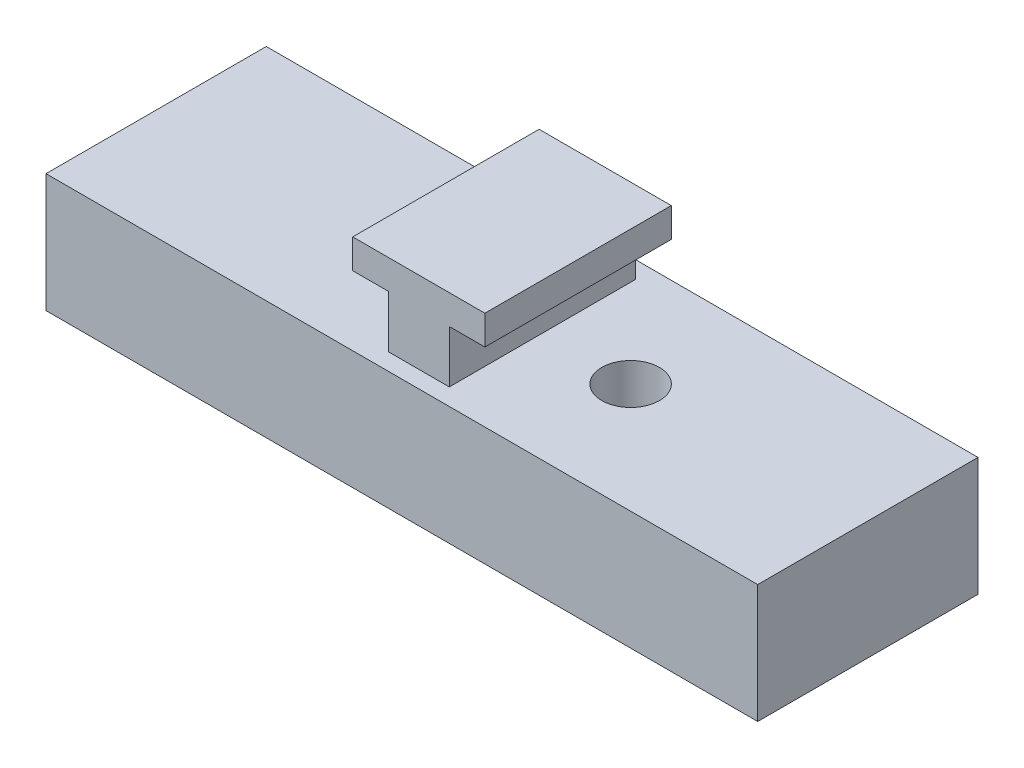
ISO-10303-21;
HEADER;
FILE_DESCRIPTION(('STEP AP214'),'2;1');
FILE_NAME('part.step','',(''),(''),'','','');
FILE_SCHEMA(('AUTOMOTIVE_DESIGN { 1 0 10303 214 1 1 1 1 }'));
ENDSEC;
DATA;
#1=APPLICATION_CONTEXT('core data for automotive mechanical design processes');
#2=APPLICATION_PROTOCOL_DEFINITION('international standard','automotive_design',2000,#1);
#3=PRODUCT_CONTEXT('',#1,'mechanical');
#4=PRODUCT('Part','Part','',(#3));
#5=PRODUCT_RELATED_PRODUCT_CATEGORY('part','',(#4));
#6=PRODUCT_DEFINITION_FORMATION('','',#4);
#7=PRODUCT_DEFINITION_CONTEXT('part definition',#1,'design');
#8=PRODUCT_DEFINITION('design','',#6,#7);
#9=PRODUCT_DEFINITION_SHAPE('','',#8);
#10=(LENGTH_UNIT() NAMED_UNIT(*) SI_UNIT(.MILLI.,.METRE.));
#11=(NAMED_UNIT(*) PLANE_ANGLE_UNIT() SI_UNIT($,.RADIAN.));
#12=(NAMED_UNIT(*) SI_UNIT($,.STERADIAN.) SOLID_ANGLE_UNIT());
#13=UNCERTAINTY_MEASURE_WITH_UNIT(LENGTH_MEASURE(1.E-05),#10,'distance_accuracy_value','');
#14=(GEOMETRIC_REPRESENTATION_CONTEXT(3) GLOBAL_UNCERTAINTY_ASSIGNED_CONTEXT((#13)) GLOBAL_UNIT_ASSIGNED_CONTEXT((#10,
#11,#12)) REPRESENTATION_CONTEXT('',''));
#15=CARTESIAN_POINT('',(0.,0.,0.));
#16=DIRECTION('',(0.,0.,1.));
#17=DIRECTION('',(1.,0.,0.));
#18=AXIS2_PLACEMENT_3D('',#15,#16,#17);
#19=CARTESIAN_POINT('',(0.327366358479519,9.25267229626939,13.7793470427629));
#20=DIRECTION('',(1.,0.,0.));
#21=DIRECTION('',(0.,0.,-1.));
#22=AXIS2_PLACEMENT_3D('',#19,#20,#21);
#23=PLANE('',#22);
#24=DIRECTION('',(0.,-1.,0.));
#25=VECTOR('',#24,1.);
#26=CARTESIAN_POINT('',(0.327366358479519,9.25267229626939,2.77934704276292));
#27=LINE('',#26,#25);
#28=CARTESIAN_POINT('',(0.327366358479519,9.25267229626939,2.77934704276292));
#29=VERTEX_POINT('',#28);
#30=CARTESIAN_POINT('',(0.327366358479519,7.52267229626939,2.77934704276292));
#31=VERTEX_POINT('',#30);
#32=EDGE_CURVE('P0_E112',#29,#31,#27,.T.);
#33=ORIENTED_EDGE('',*,*,#32,.T.);
#34=DIRECTION('',(0.,0.,-1.));
#35=VECTOR('',#34,1.);
#36=CARTESIAN_POINT('',(0.327366358479519,7.52267229626939,13.7793470427629));
#37=LINE('',#36,#35);
#38=CARTESIAN_POINT('',(0.327366358479519,7.52267229626939,13.7793470427629));
#39=VERTEX_POINT('',#38);
#40=EDGE_CURVE('P0_E11',#39,#31,#37,.T.);
#41=ORIENTED_EDGE('',*,*,#40,.F.);
#42=DIRECTION('',(0.,-1.,0.));
#43=VECTOR('',#42,1.);
#44=CARTESIAN_POINT('',(0.327366358479519,9.25267229626939,13.7793470427629));
#45=LINE('',#44,#43);
#46=CARTESIAN_POINT('',(0.327366358479519,9.25267229626939,13.7793470427629));
#47=VERTEX_POINT('',#46);
#48=EDGE_CURVE('P0_E126',#47,#39,#45,.T.);
#49=ORIENTED_EDGE('',*,*,#48,.F.);
#50=DIRECTION('',(0.,0.,-1.));
#51=VECTOR('',#50,1.);
#52=CARTESIAN_POINT('',(0.327366358479519,9.25267229626939,13.7793470427629));
#53=LINE('',#52,#51);
#54=EDGE_CURVE('P0_E108',#47,#29,#53,.T.);
#55=ORIENTED_EDGE('',*,*,#54,.T.);
#56=EDGE_LOOP('',(#33,#41,#49,#55));
#57=FACE_BOUND('',#56,.T.);
#58=ADVANCED_FACE('P0_F16',(#57),#23,.F.);
#59=CARTESIAN_POINT('',(0.327366358479519,7.52267229626939,13.7793470427629));
#60=DIRECTION('',(0.,1.,0.));
#61=DIRECTION('',(0.,0.,1.));
#62=AXIS2_PLACEMENT_3D('',#59,#60,#61);
#63=PLANE('',#62);
#64=DIRECTION('',(1.,0.,0.));
#65=VECTOR('',#64,1.);
#66=CARTESIAN_POINT('',(0.327366358479519,7.52267229626939,2.77934704276292));
#67=LINE('',#66,#65);
#68=CARTESIAN_POINT('',(2.42736635847952,7.52267229626939,2.77934704276292));
#69=VERTEX_POINT('',#68);
#70=EDGE_CURVE('P0_E115',#31,#69,#67,.T.);
#71=ORIENTED_EDGE('',*,*,#70,.T.);
#72=DIRECTION('',(0.,0.,-1.));
#73=VECTOR('',#72,1.);
#74=CARTESIAN_POINT('',(2.42736635847952,7.52267229626939,13.7793470427629));
#75=LINE('',#74,#73);
#76=CARTESIAN_POINT('',(2.42736635847952,7.52267229626939,13.7793470427629));
#77=VERTEX_POINT('',#76);
#78=EDGE_CURVE('P0_E24',#77,#69,#75,.T.);
#79=ORIENTED_EDGE('',*,*,#78,.F.);
#80=DIRECTION('',(1.,0.,0.));
#81=VECTOR('',#80,1.);
#82=CARTESIAN_POINT('',(0.327366358479519,7.52267229626939,13.7793470427629));
#83=LINE('',#82,#81);
#84=EDGE_CURVE('P0_E75',#39,#77,#83,.T.);
#85=ORIENTED_EDGE('',*,*,#84,.F.);
#86=ORIENTED_EDGE('',*,*,#40,.T.);
#87=EDGE_LOOP('',(#71,#79,#85,#86));
#88=FACE_BOUND('',#87,.T.);
#89=ADVANCED_FACE('P0_F161',(#88),#63,.F.);
#90=CARTESIAN_POINT('',(2.42736635847952,7.52267229626939,13.7793470427629));
#91=DIRECTION('',(1.,0.,0.));
#92=DIRECTION('',(0.,0.,-1.));
#93=AXIS2_PLACEMENT_3D('',#90,#91,#92);
#94=PLANE('',#93);
#95=DIRECTION('',(0.,-1.,0.));
#96=VECTOR('',#95,1.);
#97=CARTESIAN_POINT('',(2.42736635847952,7.52267229626939,2.77934704276292));
#98=LINE('',#97,#96);
#99=CARTESIAN_POINT('',(2.42736635847952,0.433651732053231,2.77934704276292));
#100=VERTEX_POINT('',#99);
#101=EDGE_CURVE('P0_E117',#69,#100,#98,.T.);
#102=ORIENTED_EDGE('',*,*,#101,.T.);
#103=DIRECTION('',(0.,0.,-1.));
#104=VECTOR('',#103,1.);
#105=CARTESIAN_POINT('',(2.42736635847952,0.433651732053231,13.7793470427629));
#106=LINE('',#105,#104);
#107=CARTESIAN_POINT('',(2.42736635847952,0.433651732053231,13.7793470427629));
#108=VERTEX_POINT('',#107);
#109=EDGE_CURVE('P0_E133',#108,#100,#106,.T.);
#110=ORIENTED_EDGE('',*,*,#109,.F.);
#111=DIRECTION('',(0.,-1.,0.));
#112=VECTOR('',#111,1.);
#113=CARTESIAN_POINT('',(2.42736635847952,7.52267229626939,13.7793470427629));
#114=LINE('',#113,#112);
#115=EDGE_CURVE('P0_E141',#77,#108,#114,.T.);
#116=ORIENTED_EDGE('',*,*,#115,.F.);
#117=ORIENTED_EDGE('',*,*,#78,.T.);
#118=EDGE_LOOP('',(#102,#110,#116,#117));
#119=FACE_BOUND('',#118,.T.);
#120=ADVANCED_FACE('P0_F139',(#119),#94,.F.);
#121=CARTESIAN_POINT('',(2.42736635847952,0.433651732053231,13.7793470427629));
#122=DIRECTION('',(0.,1.,0.));
#123=DIRECTION('',(0.,0.,1.));
#124=AXIS2_PLACEMENT_3D('',#121,#122,#123);
#125=PLANE('',#124);
#126=DIRECTION('',(1.,0.,0.));
#127=VECTOR('',#126,1.);
#128=CARTESIAN_POINT('',(2.42736635847952,0.433651732053231,2.77934704276292));
#129=LINE('',#128,#127);
#130=CARTESIAN_POINT('',(6.02736635847952,0.433651732053231,2.77934704276292));
#131=VERTEX_POINT('',#130);
#132=EDGE_CURVE('P0_E119',#100,#131,#129,.T.);
#133=ORIENTED_EDGE('',*,*,#132,.T.);
#134=DIRECTION('',(0.,0.,-1.));
#135=VECTOR('',#134,1.);
#136=CARTESIAN_POINT('',(6.02736635847952,0.433651732053231,13.7793470427629));
#137=LINE('',#136,#135);
#138=CARTESIAN_POINT('',(6.02736635847952,0.433651732053231,13.7793470427629));
#139=VERTEX_POINT('',#138);
#140=EDGE_CURVE('P0_E130',#139,#131,#137,.T.);
#141=ORIENTED_EDGE('',*,*,#140,.F.);
#142=DIRECTION('',(1.,0.,0.));
#143=VECTOR('',#142,1.);
#144=CARTESIAN_POINT('',(2.42736635847952,0.433651732053231,13.7793470427629));
#145=LINE('',#144,#143);
#146=EDGE_CURVE('P0_E153',#108,#139,#145,.T.);
#147=ORIENTED_EDGE('',*,*,#146,.F.);
#148=ORIENTED_EDGE('',*,*,#109,.T.);
#149=EDGE_LOOP('',(#133,#141,#147,#148));
#150=FACE_BOUND('',#149,.T.);
#151=ADVANCED_FACE('P0_F149',(#150),#125,.F.);
#152=CARTESIAN_POINT('',(6.02736635847952,7.52267229626939,13.7793470427629));
#153=DIRECTION('',(-1.,0.,0.));
#154=DIRECTION('',(0.,0.,1.));
#155=AXIS2_PLACEMENT_3D('',#152,#153,#154);
#156=PLANE('',#155);
#157=DIRECTION('',(0.,1.,0.));
#158=VECTOR('',#157,1.);
#159=CARTESIAN_POINT('',(6.02736635847952,7.52267229626939,2.77934704276292));
#160=LINE('',#159,#158);
#161=CARTESIAN_POINT('',(6.02736635847952,7.52267229626939,2.77934704276292));
#162=VERTEX_POINT('',#161);
#163=EDGE_CURVE('P0_E121',#131,#162,#160,.T.);
#164=ORIENTED_EDGE('',*,*,#163,.T.);
#165=DIRECTION('',(0.,0.,-1.));
#166=VECTOR('',#165,1.);
#167=CARTESIAN_POINT('',(6.02736635847952,7.52267229626939,13.7793470427629));
#168=LINE('',#167,#166);
#169=CARTESIAN_POINT('',(6.02736635847952,7.52267229626939,13.7793470427629));
#170=VERTEX_POINT('',#169);
#171=EDGE_CURVE('P0_E103',#170,#162,#168,.T.);
#172=ORIENTED_EDGE('',*,*,#171,.F.);
#173=DIRECTION('',(0.,1.,0.));
#174=VECTOR('',#173,1.);
#175=CARTESIAN_POINT('',(6.02736635847952,7.52267229626939,13.7793470427629));
#176=LINE('',#175,#174);
#177=EDGE_CURVE('P0_E94',#139,#170,#176,.T.);
#178=ORIENTED_EDGE('',*,*,#177,.F.);
#179=ORIENTED_EDGE('',*,*,#140,.T.);
#180=EDGE_LOOP('',(#164,#172,#178,#179));
#181=FACE_BOUND('',#180,.T.);
#182=ADVANCED_FACE('P0_F152',(#181),#156,.F.);
#183=CARTESIAN_POINT('',(8.12736635847952,7.52267229626939,13.7793470427629));
#184=DIRECTION('',(0.,1.,0.));
#185=DIRECTION('',(0.,0.,1.));
#186=AXIS2_PLACEMENT_3D('',#183,#184,#185);
#187=PLANE('',#186);
#188=DIRECTION('',(1.,0.,0.));
#189=VECTOR('',#188,1.);
#190=CARTESIAN_POINT('',(8.12736635847952,7.52267229626939,2.77934704276292));
#191=LINE('',#190,#189);
#192=CARTESIAN_POINT('',(8.12736635847952,7.52267229626939,2.77934704276292));
#193=VERTEX_POINT('',#192);
#194=EDGE_CURVE('P0_E102',#162,#193,#191,.T.);
#195=ORIENTED_EDGE('',*,*,#194,.T.);
#196=DIRECTION('',(0.,0.,-1.));
#197=VECTOR('',#196,1.);
#198=CARTESIAN_POINT('',(8.12736635847952,7.52267229626939,13.7793470427629));
#199=LINE('',#198,#197);
#200=CARTESIAN_POINT('',(8.12736635847952,7.52267229626939,13.7793470427629));
#201=VERTEX_POINT('',#200);
#202=EDGE_CURVE('P0_E99',#201,#193,#199,.T.);
#203=ORIENTED_EDGE('',*,*,#202,.F.);
#204=DIRECTION('',(1.,0.,0.));
#205=VECTOR('',#204,1.);
#206=CARTESIAN_POINT('',(8.12736635847952,7.52267229626939,13.7793470427629));
#207=LINE('',#206,#205);
#208=EDGE_CURVE('P0_E88',#170,#201,#207,.T.);
#209=ORIENTED_EDGE('',*,*,#208,.F.);
#210=ORIENTED_EDGE('',*,*,#171,.T.);
#211=EDGE_LOOP('',(#195,#203,#209,#210));
#212=FACE_BOUND('',#211,.T.);
#213=ADVANCED_FACE('P0_F100',(#212),#187,.F.);
#214=CARTESIAN_POINT('',(8.12736635847952,9.25267229626939,13.7793470427629));
#215=DIRECTION('',(-1.,0.,0.));
#216=DIRECTION('',(0.,0.,1.));
#217=AXIS2_PLACEMENT_3D('',#214,#215,#216);
#218=PLANE('',#217);
#219=DIRECTION('',(0.,1.,0.));
#220=VECTOR('',#219,1.);
#221=CARTESIAN_POINT('',(8.12736635847952,9.25267229626939,2.77934704276292));
#222=LINE('',#221,#220);
#223=CARTESIAN_POINT('',(8.12736635847952,9.25267229626939,2.77934704276292));
#224=VERTEX_POINT('',#223);
#225=EDGE_CURVE('P0_E61',#193,#224,#222,.T.);
#226=ORIENTED_EDGE('',*,*,#225,.T.);
#227=DIRECTION('',(0.,0.,-1.));
#228=VECTOR('',#227,1.);
#229=CARTESIAN_POINT('',(8.12736635847952,9.25267229626939,13.7793470427629));
#230=LINE('',#229,#228);
#231=CARTESIAN_POINT('',(8.12736635847952,9.25267229626939,13.7793470427629));
#232=VERTEX_POINT('',#231);
#233=EDGE_CURVE('P0_E104',#232,#224,#230,.T.);
#234=ORIENTED_EDGE('',*,*,#233,.F.);
#235=DIRECTION('',(0.,1.,0.));
#236=VECTOR('',#235,1.);
#237=CARTESIAN_POINT('',(8.12736635847952,9.25267229626939,13.7793470427629));
#238=LINE('',#237,#236);
#239=EDGE_CURVE('P0_E92',#201,#232,#238,.T.);
#240=ORIENTED_EDGE('',*,*,#239,.F.);
#241=ORIENTED_EDGE('',*,*,#202,.T.);
#242=EDGE_LOOP('',(#226,#234,#240,#241));
#243=FACE_BOUND('',#242,.T.);
#244=ADVANCED_FACE('P0_F106',(#243),#218,.F.);
#245=CARTESIAN_POINT('',(0.327366358479519,9.25267229626939,13.7793470427629));
#246=DIRECTION('',(0.,-1.,0.));
#247=DIRECTION('',(0.,0.,-1.));
#248=AXIS2_PLACEMENT_3D('',#245,#246,#247);
#249=PLANE('',#248);
#250=DIRECTION('',(-1.,0.,0.));
#251=VECTOR('',#250,1.);
#252=CARTESIAN_POINT('',(0.327366358479519,9.25267229626939,2.77934704276292));
#253=LINE('',#252,#251);
#254=EDGE_CURVE('P0_E67',#224,#29,#253,.T.);
#255=ORIENTED_EDGE('',*,*,#254,.T.);
#256=ORIENTED_EDGE('',*,*,#54,.F.);
#257=DIRECTION('',(-1.,0.,0.));
#258=VECTOR('',#257,1.);
#259=CARTESIAN_POINT('',(0.327366358479519,9.25267229626939,13.7793470427629));
#260=LINE('',#259,#258);
#261=EDGE_CURVE('P0_E32',#232,#47,#260,.T.);
#262=ORIENTED_EDGE('',*,*,#261,.F.);
#263=ORIENTED_EDGE('',*,*,#233,.T.);
#264=EDGE_LOOP('',(#255,#256,#262,#263));
#265=FACE_BOUND('',#264,.T.);
#266=ADVANCED_FACE('P0_F178',(#265),#249,.F.);
#267=CARTESIAN_POINT('',(40.5006319315753,-15.2900394360997,13.7793470427629));
#268=DIRECTION('',(0.,0.,1.));
#269=DIRECTION('',(1.,0.,0.));
#270=AXIS2_PLACEMENT_3D('',#267,#268,#269);
#271=PLANE('',#270);
#272=ORIENTED_EDGE('',*,*,#48,.T.);
#273=ORIENTED_EDGE('',*,*,#84,.T.);
#274=ORIENTED_EDGE('',*,*,#115,.T.);
#275=ORIENTED_EDGE('',*,*,#146,.T.);
#276=ORIENTED_EDGE('',*,*,#177,.T.);
#277=ORIENTED_EDGE('',*,*,#208,.T.);
#278=ORIENTED_EDGE('',*,*,#239,.T.);
#279=ORIENTED_EDGE('',*,*,#261,.T.);
#280=EDGE_LOOP('',(#272,#273,#274,#275,#276,#277,#278,#279));
#281=FACE_BOUND('',#280,.T.);
#282=ADVANCED_FACE('P0_F90',(#281),#271,.T.);
#283=CARTESIAN_POINT('',(40.5006319315753,-15.2900394360997,2.77934704276292));
#284=DIRECTION('',(0.,0.,1.));
#285=DIRECTION('',(1.,0.,0.));
#286=AXIS2_PLACEMENT_3D('',#283,#284,#285);
#287=PLANE('',#286);
#288=ORIENTED_EDGE('',*,*,#32,.F.);
#289=ORIENTED_EDGE('',*,*,#254,.F.);
#290=ORIENTED_EDGE('',*,*,#225,.F.);
#291=ORIENTED_EDGE('',*,*,#194,.F.);
#292=ORIENTED_EDGE('',*,*,#163,.F.);
#293=ORIENTED_EDGE('',*,*,#132,.F.);
#294=ORIENTED_EDGE('',*,*,#101,.F.);
#295=ORIENTED_EDGE('',*,*,#70,.F.);
#296=EDGE_LOOP('',(#288,#289,#290,#291,#292,#293,#294,#295));
#297=FACE_BOUND('',#296,.T.);
#298=ADVANCED_FACE('P0_F145',(#297),#287,.F.);
#299=CLOSED_SHELL('',(#58,#89,#120,#151,#182,#213,#244,#266,#282,#298));
#300=MANIFOLD_SOLID_BREP('P0_B1',#299);
#301=CARTESIAN_POINT('',(25.2273663584795,-2.56634826794677,1.77934704276293));
#302=DIRECTION('',(0.,0.,1.));
#303=DIRECTION('',(-1.,0.,0.));
#304=AXIS2_PLACEMENT_3D('',#301,#302,#303);
#305=PLANE('',#304);
#306=DIRECTION('',(1.,0.,0.));
#307=VECTOR('',#306,1.);
#308=CARTESIAN_POINT('',(25.2273663584795,4.43365173205323,1.77934704276293));
#309=LINE('',#308,#307);
#310=CARTESIAN_POINT('',(-16.7726336415205,4.43365173205323,1.77934704276293));
#311=VERTEX_POINT('',#310);
#312=CARTESIAN_POINT('',(25.2273663584795,4.43365173205323,1.77934704276293));
#313=VERTEX_POINT('',#312);
#314=EDGE_CURVE('P1_E127',#311,#313,#309,.T.);
#315=ORIENTED_EDGE('',*,*,#314,.T.);
#316=DIRECTION('',(0.,1.,0.));
#317=VECTOR('',#316,1.);
#318=CARTESIAN_POINT('',(25.2273663584795,-2.56634826794677,1.77934704276293));
#319=LINE('',#318,#317);
#320=CARTESIAN_POINT('',(25.2273663584795,-2.56634826794677,1.77934704276293));
#321=VERTEX_POINT('',#320);
#322=EDGE_CURVE('P1_E11',#321,#313,#319,.T.);
#323=ORIENTED_EDGE('',*,*,#322,.F.);
#324=DIRECTION('',(1.,0.,0.));
#325=VECTOR('',#324,1.);
#326=CARTESIAN_POINT('',(25.2273663584795,-2.56634826794677,1.77934704276293));
#327=LINE('',#326,#325);
#328=CARTESIAN_POINT('',(-16.7726336415205,-2.56634826794677,1.77934704276293));
#329=VERTEX_POINT('',#328);
#330=EDGE_CURVE('P1_E131',#329,#321,#327,.T.);
#331=ORIENTED_EDGE('',*,*,#330,.F.);
#332=DIRECTION('',(0.,1.,0.));
#333=VECTOR('',#332,1.);
#334=CARTESIAN_POINT('',(-16.7726336415205,-2.56634826794677,1.77934704276293));
#335=LINE('',#334,#333);
#336=EDGE_CURVE('P1_E137',#329,#311,#335,.T.);
#337=ORIENTED_EDGE('',*,*,#336,.T.);
#338=EDGE_LOOP('',(#315,#323,#331,#337));
#339=FACE_BOUND('',#338,.T.);
#340=ADVANCED_FACE('P1_F16',(#339),#305,.F.);
#341=CARTESIAN_POINT('',(25.2273663584795,-2.56634826794677,14.7793470427629));
#342=DIRECTION('',(-1.,0.,0.));
#343=DIRECTION('',(0.,1.,0.));
#344=AXIS2_PLACEMENT_3D('',#341,#342,#343);
#345=PLANE('',#344);
#346=DIRECTION('',(0.,0.,1.));
#347=VECTOR('',#346,1.);
#348=CARTESIAN_POINT('',(25.2273663584795,4.43365173205323,14.7793470427629));
#349=LINE('',#348,#347);
#350=CARTESIAN_POINT('',(25.2273663584795,4.43365173205323,14.7793470427629));
#351=VERTEX_POINT('',#350);
#352=EDGE_CURVE('P1_E140',#313,#351,#349,.T.);
#353=ORIENTED_EDGE('',*,*,#352,.T.);
#354=DIRECTION('',(0.,1.,0.));
#355=VECTOR('',#354,1.);
#356=CARTESIAN_POINT('',(25.2273663584795,-2.56634826794677,14.7793470427629));
#357=LINE('',#356,#355);
#358=CARTESIAN_POINT('',(25.2273663584795,-2.56634826794677,14.7793470427629));
#359=VERTEX_POINT('',#358);
#360=EDGE_CURVE('P1_E23',#359,#351,#357,.T.);
#361=ORIENTED_EDGE('',*,*,#360,.F.);
#362=DIRECTION('',(0.,0.,1.));
#363=VECTOR('',#362,1.);
#364=CARTESIAN_POINT('',(25.2273663584795,-2.56634826794677,14.7793470427629));
#365=LINE('',#364,#363);
#366=EDGE_CURVE('P1_E67',#321,#359,#365,.T.);
#367=ORIENTED_EDGE('',*,*,#366,.F.);
#368=ORIENTED_EDGE('',*,*,#322,.T.);
#369=EDGE_LOOP('',(#353,#361,#367,#368));
#370=FACE_BOUND('',#369,.T.);
#371=ADVANCED_FACE('P1_F170',(#370),#345,.F.);
#372=CARTESIAN_POINT('',(25.2273663584795,-2.56634826794677,14.7793470427629));
#373=DIRECTION('',(0.,0.,-1.));
#374=DIRECTION('',(1.,0.,0.));
#375=AXIS2_PLACEMENT_3D('',#372,#373,#374);
#376=PLANE('',#375);
#377=DIRECTION('',(-1.,0.,0.));
#378=VECTOR('',#377,1.);
#379=CARTESIAN_POINT('',(25.2273663584795,4.43365173205323,14.7793470427629));
#380=LINE('',#379,#378);
#381=CARTESIAN_POINT('',(-16.7726336415205,4.43365173205323,14.7793470427629));
#382=VERTEX_POINT('',#381);
#383=EDGE_CURVE('P1_E142',#351,#382,#380,.T.);
#384=ORIENTED_EDGE('',*,*,#383,.T.);
#385=DIRECTION('',(0.,1.,0.));
#386=VECTOR('',#385,1.);
#387=CARTESIAN_POINT('',(-16.7726336415205,-2.56634826794677,14.7793470427629));
#388=LINE('',#387,#386);
#389=CARTESIAN_POINT('',(-16.7726336415205,-2.56634826794677,14.7793470427629));
#390=VERTEX_POINT('',#389);
#391=EDGE_CURVE('P1_E146',#390,#382,#388,.T.);
#392=ORIENTED_EDGE('',*,*,#391,.F.);
#393=DIRECTION('',(-1.,0.,0.));
#394=VECTOR('',#393,1.);
#395=CARTESIAN_POINT('',(25.2273663584795,-2.56634826794677,14.7793470427629));
#396=LINE('',#395,#394);
#397=EDGE_CURVE('P1_E134',#359,#390,#396,.T.);
#398=ORIENTED_EDGE('',*,*,#397,.F.);
#399=ORIENTED_EDGE('',*,*,#360,.T.);
#400=EDGE_LOOP('',(#384,#392,#398,#399));
#401=FACE_BOUND('',#400,.T.);
#402=ADVANCED_FACE('P1_F151',(#401),#376,.F.);
#403=CARTESIAN_POINT('',(-16.7726336415205,-2.56634826794677,14.7793470427629));
#404=DIRECTION('',(1.,0.,0.));
#405=DIRECTION('',(0.,-1.,0.));
#406=AXIS2_PLACEMENT_3D('',#403,#404,#405);
#407=PLANE('',#406);
#408=DIRECTION('',(0.,0.,-1.));
#409=VECTOR('',#408,1.);
#410=CARTESIAN_POINT('',(-16.7726336415205,4.43365173205323,14.7793470427629));
#411=LINE('',#410,#409);
#412=EDGE_CURVE('P1_E60',#382,#311,#411,.T.);
#413=ORIENTED_EDGE('',*,*,#412,.T.);
#414=ORIENTED_EDGE('',*,*,#336,.F.);
#415=DIRECTION('',(0.,0.,-1.));
#416=VECTOR('',#415,1.);
#417=CARTESIAN_POINT('',(-16.7726336415205,-2.56634826794677,14.7793470427629));
#418=LINE('',#417,#416);
#419=EDGE_CURVE('P1_E39',#390,#329,#418,.T.);
#420=ORIENTED_EDGE('',*,*,#419,.F.);
#421=ORIENTED_EDGE('',*,*,#391,.T.);
#422=EDGE_LOOP('',(#413,#414,#420,#421));
#423=FACE_BOUND('',#422,.T.);
#424=ADVANCED_FACE('P1_F159',(#423),#407,.F.);
#425=CARTESIAN_POINT('',(-30.8506732981628,-2.56634826794677,-10.8602456608852));
#426=DIRECTION('',(0.,-1.,0.));
#427=DIRECTION('',(0.,0.,-1.));
#428=AXIS2_PLACEMENT_3D('',#425,#426,#427);
#429=PLANE('',#428);
#430=CARTESIAN_POINT('',(11.2273663584795,-2.56634826794677,8.27934704276293));
#431=DIRECTION('',(0.,-1.,0.));
#432=DIRECTION('',(0.,0.,-1.));
#433=AXIS2_PLACEMENT_3D('',#430,#431,#432);
#434=CIRCLE('',#433,1.7);
#435=CARTESIAN_POINT('',(11.2273663584795,-2.56634826794677,6.57934704276293));
#436=VERTEX_POINT('',#435);
#437=EDGE_CURVE('P1_E115',#436,#436,#434,.F.);
#438=ORIENTED_EDGE('',*,*,#437,.T.);
#439=EDGE_LOOP('',(#438));
#440=FACE_BOUND('',#439,.T.);
#441=ORIENTED_EDGE('',*,*,#330,.T.);
#442=ORIENTED_EDGE('',*,*,#366,.T.);
#443=ORIENTED_EDGE('',*,*,#397,.T.);
#444=ORIENTED_EDGE('',*,*,#419,.T.);
#445=EDGE_LOOP('',(#441,#442,#443,#444));
#446=FACE_BOUND('',#445,.T.);
#447=ADVANCED_FACE('P1_F161',(#440,#446),#429,.T.);
#448=CARTESIAN_POINT('',(-30.8506732981628,4.43365173205323,-10.8602456608853));
#449=DIRECTION('',(0.,-1.,0.));
#450=DIRECTION('',(0.,0.,-1.));
#451=AXIS2_PLACEMENT_3D('',#448,#449,#450);
#452=PLANE('',#451);
#453=CARTESIAN_POINT('',(11.2273663584795,4.43365173205323,8.27934704276293));
#454=DIRECTION('',(0.,-1.,0.));
#455=DIRECTION('',(0.,0.,-1.));
#456=AXIS2_PLACEMENT_3D('',#453,#454,#455);
#457=CIRCLE('',#456,1.7);
#458=CARTESIAN_POINT('',(11.2273663584795,4.43365173205323,6.57934704276293));
#459=VERTEX_POINT('',#458);
#460=EDGE_CURVE('P1_E271',#459,#459,#457,.T.);
#461=ORIENTED_EDGE('',*,*,#460,.T.);
#462=EDGE_LOOP('',(#461));
#463=FACE_BOUND('',#462,.T.);
#464=DIRECTION('',(0.,0.,-1.));
#465=VECTOR('',#464,1.);
#466=CARTESIAN_POINT('',(6.02736635847952,4.43365173205323,2.77934704276292));
#467=LINE('',#466,#465);
#468=CARTESIAN_POINT('',(6.02736635847952,4.43365173205323,13.7793470427629));
#469=VERTEX_POINT('',#468);
#470=CARTESIAN_POINT('',(6.02736635847952,4.43365173205323,2.77934704276292));
#471=VERTEX_POINT('',#470);
#472=EDGE_CURVE('P1_E121',#469,#471,#467,.T.);
#473=ORIENTED_EDGE('',*,*,#472,.F.);
#474=DIRECTION('',(1.,0.,0.));
#475=VECTOR('',#474,1.);
#476=CARTESIAN_POINT('',(6.02736635847952,4.43365173205323,13.7793470427629));
#477=LINE('',#476,#475);
#478=CARTESIAN_POINT('',(2.42736635847952,4.43365173205323,13.7793470427629));
#479=VERTEX_POINT('',#478);
#480=EDGE_CURVE('P1_E30',#479,#469,#477,.T.);
#481=ORIENTED_EDGE('',*,*,#480,.F.);
#482=DIRECTION('',(0.,0.,1.));
#483=VECTOR('',#482,1.);
#484=CARTESIAN_POINT('',(2.42736635847952,4.43365173205323,2.77934704276292));
#485=LINE('',#484,#483);
#486=CARTESIAN_POINT('',(2.42736635847952,4.43365173205323,2.77934704276292));
#487=VERTEX_POINT('',#486);
#488=EDGE_CURVE('P1_E109',#487,#479,#485,.T.);
#489=ORIENTED_EDGE('',*,*,#488,.F.);
#490=DIRECTION('',(-1.,0.,0.));
#491=VECTOR('',#490,1.);
#492=CARTESIAN_POINT('',(6.02736635847952,4.43365173205323,2.77934704276292));
#493=LINE('',#492,#491);
#494=EDGE_CURVE('P1_E112',#471,#487,#493,.T.);
#495=ORIENTED_EDGE('',*,*,#494,.F.);
#496=EDGE_LOOP('',(#473,#481,#489,#495));
#497=FACE_BOUND('',#496,.T.);
#498=ORIENTED_EDGE('',*,*,#314,.F.);
#499=ORIENTED_EDGE('',*,*,#412,.F.);
#500=ORIENTED_EDGE('',*,*,#383,.F.);
#501=ORIENTED_EDGE('',*,*,#352,.F.);
#502=EDGE_LOOP('',(#498,#499,#500,#501));
#503=FACE_BOUND('',#502,.T.);
#504=ADVANCED_FACE('P1_F155',(#463,#497,#503),#452,.F.);
#505=CARTESIAN_POINT('',(6.02736635847952,0.43365173205323,13.7793470427629));
#506=DIRECTION('',(0.,0.,1.));
#507=DIRECTION('',(0.,-1.,0.));
#508=AXIS2_PLACEMENT_3D('',#505,#506,#507);
#509=PLANE('',#508);
#510=ORIENTED_EDGE('',*,*,#480,.T.);
#511=DIRECTION('',(0.,1.,0.));
#512=VECTOR('',#511,1.);
#513=CARTESIAN_POINT('',(6.02736635847952,0.43365173205323,13.7793470427629));
#514=LINE('',#513,#512);
#515=CARTESIAN_POINT('',(6.02736635847952,0.43365173205323,13.7793470427629));
#516=VERTEX_POINT('',#515);
#517=EDGE_CURVE('P1_E87',#516,#469,#514,.T.);
#518=ORIENTED_EDGE('',*,*,#517,.F.);
#519=DIRECTION('',(1.,0.,0.));
#520=VECTOR('',#519,1.);
#521=CARTESIAN_POINT('',(6.02736635847952,0.43365173205323,13.7793470427629));
#522=LINE('',#521,#520);
#523=CARTESIAN_POINT('',(2.42736635847952,0.43365173205323,13.7793470427629));
#524=VERTEX_POINT('',#523);
#525=EDGE_CURVE('P1_E91',#524,#516,#522,.T.);
#526=ORIENTED_EDGE('',*,*,#525,.F.);
#527=DIRECTION('',(0.,1.,0.));
#528=VECTOR('',#527,1.);
#529=CARTESIAN_POINT('',(2.42736635847952,0.43365173205323,13.7793470427629));
#530=LINE('',#529,#528);
#531=EDGE_CURVE('P1_E125',#524,#479,#530,.T.);
#532=ORIENTED_EDGE('',*,*,#531,.T.);
#533=EDGE_LOOP('',(#510,#518,#526,#532));
#534=FACE_BOUND('',#533,.T.);
#535=ADVANCED_FACE('P1_F89',(#534),#509,.F.);
#536=CARTESIAN_POINT('',(2.42736635847952,0.43365173205323,2.77934704276292));
#537=DIRECTION('',(-1.,0.,0.));
#538=DIRECTION('',(0.,1.,0.));
#539=AXIS2_PLACEMENT_3D('',#536,#537,#538);
#540=PLANE('',#539);
#541=ORIENTED_EDGE('',*,*,#488,.T.);
#542=ORIENTED_EDGE('',*,*,#531,.F.);
#543=DIRECTION('',(0.,0.,1.));
#544=VECTOR('',#543,1.);
#545=CARTESIAN_POINT('',(2.42736635847952,0.43365173205323,2.77934704276292));
#546=LINE('',#545,#544);
#547=CARTESIAN_POINT('',(2.42736635847952,0.43365173205323,2.77934704276292));
#548=VERTEX_POINT('',#547);
#549=EDGE_CURVE('P1_E97',#548,#524,#546,.T.);
#550=ORIENTED_EDGE('',*,*,#549,.F.);
#551=DIRECTION('',(0.,1.,0.));
#552=VECTOR('',#551,1.);
#553=CARTESIAN_POINT('',(2.42736635847952,0.43365173205323,2.77934704276292));
#554=LINE('',#553,#552);
#555=EDGE_CURVE('P1_E128',#548,#487,#554,.T.);
#556=ORIENTED_EDGE('',*,*,#555,.T.);
#557=EDGE_LOOP('',(#541,#542,#550,#556));
#558=FACE_BOUND('',#557,.T.);
#559=ADVANCED_FACE('P1_F215',(#558),#540,.F.);
#560=CARTESIAN_POINT('',(6.02736635847952,0.43365173205323,2.77934704276292));
#561=DIRECTION('',(0.,0.,-1.));
#562=DIRECTION('',(0.,1.,0.));
#563=AXIS2_PLACEMENT_3D('',#560,#561,#562);
#564=PLANE('',#563);
#565=ORIENTED_EDGE('',*,*,#494,.T.);
#566=ORIENTED_EDGE('',*,*,#555,.F.);
#567=DIRECTION('',(-1.,0.,0.));
#568=VECTOR('',#567,1.);
#569=CARTESIAN_POINT('',(6.02736635847952,0.43365173205323,2.77934704276292));
#570=LINE('',#569,#568);
#571=CARTESIAN_POINT('',(6.02736635847952,0.43365173205323,2.77934704276292));
#572=VERTEX_POINT('',#571);
#573=EDGE_CURVE('P1_E105',#572,#548,#570,.T.);
#574=ORIENTED_EDGE('',*,*,#573,.F.);
#575=DIRECTION('',(0.,1.,0.));
#576=VECTOR('',#575,1.);
#577=CARTESIAN_POINT('',(6.02736635847952,0.43365173205323,2.77934704276292));
#578=LINE('',#577,#576);
#579=EDGE_CURVE('P1_E96',#572,#471,#578,.T.);
#580=ORIENTED_EDGE('',*,*,#579,.T.);
#581=EDGE_LOOP('',(#565,#566,#574,#580));
#582=FACE_BOUND('',#581,.T.);
#583=ADVANCED_FACE('P1_F224',(#582),#564,.F.);
#584=CARTESIAN_POINT('',(6.02736635847952,0.43365173205323,2.77934704276292));
#585=DIRECTION('',(1.,0.,0.));
#586=DIRECTION('',(0.,-1.,0.));
#587=AXIS2_PLACEMENT_3D('',#584,#585,#586);
#588=PLANE('',#587);
#589=ORIENTED_EDGE('',*,*,#472,.T.);
#590=ORIENTED_EDGE('',*,*,#579,.F.);
#591=DIRECTION('',(0.,0.,-1.));
#592=VECTOR('',#591,1.);
#593=CARTESIAN_POINT('',(6.02736635847952,0.43365173205323,2.77934704276292));
#594=LINE('',#593,#592);
#595=EDGE_CURVE('P1_E100',#516,#572,#594,.T.);
#596=ORIENTED_EDGE('',*,*,#595,.F.);
#597=ORIENTED_EDGE('',*,*,#517,.T.);
#598=EDGE_LOOP('',(#589,#590,#596,#597));
#599=FACE_BOUND('',#598,.T.);
#600=ADVANCED_FACE('P1_F101',(#599),#588,.F.);
#601=CARTESIAN_POINT('',(-30.8506732981628,0.433651732053231,-10.8602456608853));
#602=DIRECTION('',(0.,1.,0.));
#603=DIRECTION('',(0.,0.,1.));
#604=AXIS2_PLACEMENT_3D('',#601,#602,#603);
#605=PLANE('',#604);
#606=ORIENTED_EDGE('',*,*,#525,.T.);
#607=ORIENTED_EDGE('',*,*,#595,.T.);
#608=ORIENTED_EDGE('',*,*,#573,.T.);
#609=ORIENTED_EDGE('',*,*,#549,.T.);
#610=EDGE_LOOP('',(#606,#607,#608,#609));
#611=FACE_BOUND('',#610,.T.);
#612=ADVANCED_FACE('P1_F107',(#611),#605,.T.);
#613=CARTESIAN_POINT('',(11.2273663584795,-5.56634826794677,8.27934704276293));
#614=DIRECTION('',(0.,1.,0.));
#615=DIRECTION('',(0.,0.,1.));
#616=AXIS2_PLACEMENT_3D('',#613,#614,#615);
#617=CYLINDRICAL_SURFACE('',#616,1.7);
#618=ORIENTED_EDGE('',*,*,#437,.F.);
#619=EDGE_LOOP('',(#618));
#620=FACE_BOUND('',#619,.T.);
#621=ORIENTED_EDGE('',*,*,#460,.F.);
#622=EDGE_LOOP('',(#621));
#623=FACE_BOUND('',#622,.T.);
#624=ADVANCED_FACE('P1_F251',(#620,#623),#617,.F.);
#625=CLOSED_SHELL('',(#340,#371,#402,#424,#447,#504,#535,#559,#583,#600,#612,#624));
#626=MANIFOLD_SOLID_BREP('P1_B1',#625);
#627=ADVANCED_BREP_SHAPE_REPRESENTATION('',(#18,#300,#626),#14);
#628=SHAPE_DEFINITION_REPRESENTATION(#9,#627);
ENDSEC;
END-ISO-10303-21;
